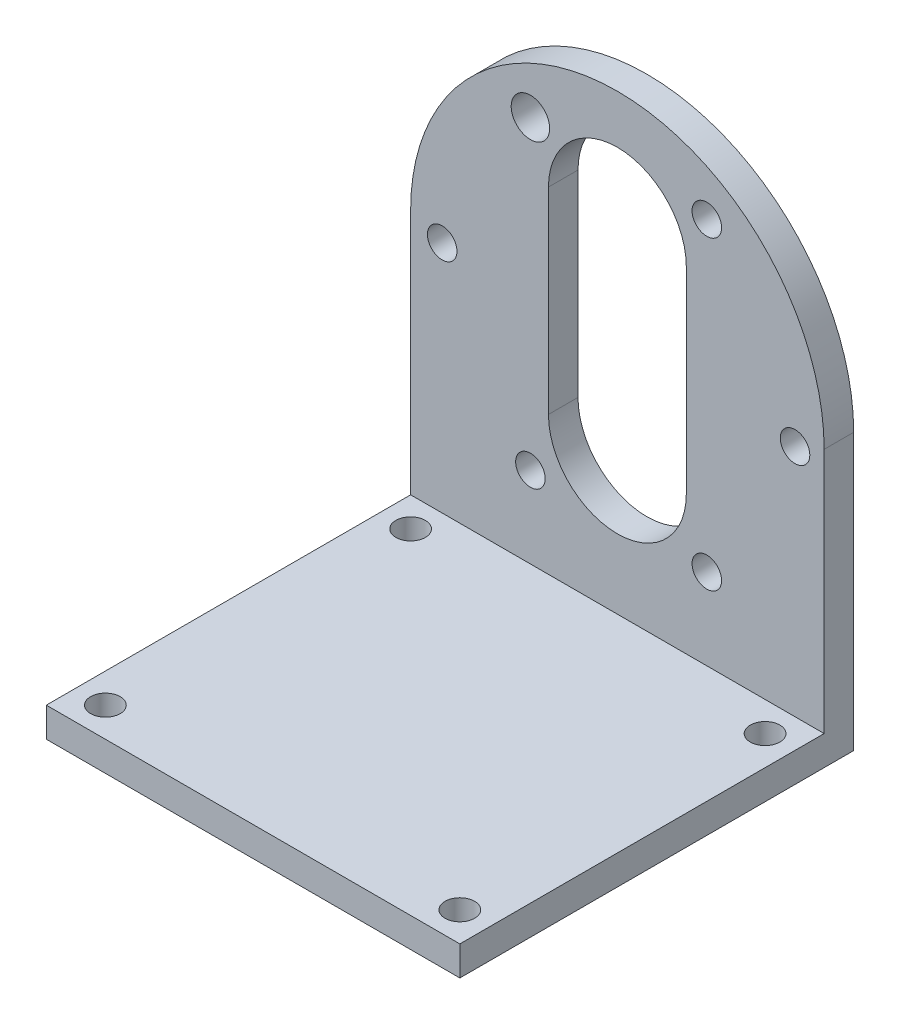
ISO-10303-21;
HEADER;
FILE_DESCRIPTION(('STEP AP214'),'2;1');
FILE_NAME('part.step','',(''),(''),'','','');
FILE_SCHEMA(('AUTOMOTIVE_DESIGN { 1 0 10303 214 1 1 1 1 }'));
ENDSEC;
DATA;
#1=APPLICATION_CONTEXT('core data for automotive mechanical design processes');
#2=APPLICATION_PROTOCOL_DEFINITION('international standard','automotive_design',2000,#1);
#3=PRODUCT_CONTEXT('',#1,'mechanical');
#4=PRODUCT('Part','Part','',(#3));
#5=PRODUCT_RELATED_PRODUCT_CATEGORY('part','',(#4));
#6=PRODUCT_DEFINITION_FORMATION('','',#4);
#7=PRODUCT_DEFINITION_CONTEXT('part definition',#1,'design');
#8=PRODUCT_DEFINITION('design','',#6,#7);
#9=PRODUCT_DEFINITION_SHAPE('','',#8);
#10=(LENGTH_UNIT() NAMED_UNIT(*) SI_UNIT(.MILLI.,.METRE.));
#11=(NAMED_UNIT(*) PLANE_ANGLE_UNIT() SI_UNIT($,.RADIAN.));
#12=(NAMED_UNIT(*) SI_UNIT($,.STERADIAN.) SOLID_ANGLE_UNIT());
#13=UNCERTAINTY_MEASURE_WITH_UNIT(LENGTH_MEASURE(1.E-05),#10,'distance_accuracy_value','');
#14=(GEOMETRIC_REPRESENTATION_CONTEXT(3) GLOBAL_UNCERTAINTY_ASSIGNED_CONTEXT((#13)) GLOBAL_UNIT_ASSIGNED_CONTEXT((#10,
#11,#12)) REPRESENTATION_CONTEXT('',''));
#15=CARTESIAN_POINT('',(0.,0.,0.));
#16=DIRECTION('',(0.,0.,1.));
#17=DIRECTION('',(1.,0.,0.));
#18=AXIS2_PLACEMENT_3D('',#15,#16,#17);
#19=CARTESIAN_POINT('',(-21.,3.,21.));
#20=DIRECTION('',(1.,0.,0.));
#21=DIRECTION('',(0.,0.,-1.));
#22=AXIS2_PLACEMENT_3D('',#19,#20,#21);
#23=PLANE('',#22);
#24=DIRECTION('',(0.,0.,1.));
#25=VECTOR('',#24,1.);
#26=CARTESIAN_POINT('',(-21.,0.,21.));
#27=LINE('',#26,#25);
#28=CARTESIAN_POINT('',(-21.,0.,-19.));
#29=VERTEX_POINT('',#28);
#30=CARTESIAN_POINT('',(-21.,0.,21.));
#31=VERTEX_POINT('',#30);
#32=EDGE_CURVE('E194',#29,#31,#27,.T.);
#33=ORIENTED_EDGE('',*,*,#32,.T.);
#34=DIRECTION('',(0.,-1.,0.));
#35=VECTOR('',#34,1.);
#36=CARTESIAN_POINT('',(-21.,3.,21.));
#37=LINE('',#36,#35);
#38=CARTESIAN_POINT('',(-21.,3.,21.));
#39=VERTEX_POINT('',#38);
#40=EDGE_CURVE('E11',#39,#31,#37,.T.);
#41=ORIENTED_EDGE('',*,*,#40,.F.);
#42=DIRECTION('',(0.,0.,1.));
#43=VECTOR('',#42,1.);
#44=CARTESIAN_POINT('',(-21.,3.,21.));
#45=LINE('',#44,#43);
#46=CARTESIAN_POINT('',(-21.,3.,-16.));
#47=VERTEX_POINT('',#46);
#48=EDGE_CURVE('E195',#47,#39,#45,.T.);
#49=ORIENTED_EDGE('',*,*,#48,.F.);
#50=DIRECTION('',(0.,1.,0.));
#51=VECTOR('',#50,1.);
#52=CARTESIAN_POINT('',(-21.,3.00000000000001,-16.));
#53=LINE('',#52,#51);
#54=CARTESIAN_POINT('',(-21.,28.,-16.0000000000001));
#55=VERTEX_POINT('',#54);
#56=EDGE_CURVE('E172',#47,#55,#53,.T.);
#57=ORIENTED_EDGE('',*,*,#56,.T.);
#58=DIRECTION('',(0.,0.,1.));
#59=VECTOR('',#58,1.);
#60=CARTESIAN_POINT('',(-21.,28.,-19.0000000000001));
#61=LINE('',#60,#59);
#62=CARTESIAN_POINT('',(-21.,28.,-19.));
#63=VERTEX_POINT('',#62);
#64=EDGE_CURVE('E180',#63,#55,#61,.T.);
#65=ORIENTED_EDGE('',*,*,#64,.F.);
#66=DIRECTION('',(0.,-1.,0.));
#67=VECTOR('',#66,1.);
#68=CARTESIAN_POINT('',(-21.,3.,-19.));
#69=LINE('',#68,#67);
#70=EDGE_CURVE('E206',#63,#29,#69,.T.);
#71=ORIENTED_EDGE('',*,*,#70,.T.);
#72=EDGE_LOOP('',(#33,#41,#49,#57,#65,#71));
#73=FACE_BOUND('',#72,.T.);
#74=ADVANCED_FACE('F39',(#73),#23,.F.);
#75=CARTESIAN_POINT('',(-21.,3.,21.));
#76=DIRECTION('',(0.,0.,-1.));
#77=DIRECTION('',(-1.,0.,0.));
#78=AXIS2_PLACEMENT_3D('',#75,#76,#77);
#79=PLANE('',#78);
#80=DIRECTION('',(1.,0.,0.));
#81=VECTOR('',#80,1.);
#82=CARTESIAN_POINT('',(-21.,0.,21.));
#83=LINE('',#82,#81);
#84=CARTESIAN_POINT('',(21.,0.,21.));
#85=VERTEX_POINT('',#84);
#86=EDGE_CURVE('E210',#31,#85,#83,.T.);
#87=ORIENTED_EDGE('',*,*,#86,.T.);
#88=DIRECTION('',(0.,-1.,0.));
#89=VECTOR('',#88,1.);
#90=CARTESIAN_POINT('',(21.,3.,21.));
#91=LINE('',#90,#89);
#92=CARTESIAN_POINT('',(21.,3.,21.));
#93=VERTEX_POINT('',#92);
#94=EDGE_CURVE('E47',#93,#85,#91,.T.);
#95=ORIENTED_EDGE('',*,*,#94,.F.);
#96=DIRECTION('',(1.,0.,0.));
#97=VECTOR('',#96,1.);
#98=CARTESIAN_POINT('',(-21.,3.,21.));
#99=LINE('',#98,#97);
#100=EDGE_CURVE('E198',#39,#93,#99,.T.);
#101=ORIENTED_EDGE('',*,*,#100,.F.);
#102=ORIENTED_EDGE('',*,*,#40,.T.);
#103=EDGE_LOOP('',(#87,#95,#101,#102));
#104=FACE_BOUND('',#103,.T.);
#105=ADVANCED_FACE('F251',(#104),#79,.F.);
#106=CARTESIAN_POINT('',(21.,3.,21.));
#107=DIRECTION('',(-1.,0.,0.));
#108=DIRECTION('',(0.,0.,1.));
#109=AXIS2_PLACEMENT_3D('',#106,#107,#108);
#110=PLANE('',#109);
#111=DIRECTION('',(0.,0.,-1.));
#112=VECTOR('',#111,1.);
#113=CARTESIAN_POINT('',(21.,0.,21.));
#114=LINE('',#113,#112);
#115=CARTESIAN_POINT('',(21.,0.,-19.));
#116=VERTEX_POINT('',#115);
#117=EDGE_CURVE('E213',#85,#116,#114,.T.);
#118=ORIENTED_EDGE('',*,*,#117,.T.);
#119=DIRECTION('',(0.,-1.,0.));
#120=VECTOR('',#119,1.);
#121=CARTESIAN_POINT('',(21.,3.,-19.));
#122=LINE('',#121,#120);
#123=CARTESIAN_POINT('',(21.,28.,-19.));
#124=VERTEX_POINT('',#123);
#125=EDGE_CURVE('E221',#124,#116,#122,.T.);
#126=ORIENTED_EDGE('',*,*,#125,.F.);
#127=DIRECTION('',(0.,0.,1.));
#128=VECTOR('',#127,1.);
#129=CARTESIAN_POINT('',(21.,28.,-19.0000000000001));
#130=LINE('',#129,#128);
#131=CARTESIAN_POINT('',(21.,28.,-16.));
#132=VERTEX_POINT('',#131);
#133=EDGE_CURVE('E179',#124,#132,#130,.T.);
#134=ORIENTED_EDGE('',*,*,#133,.T.);
#135=DIRECTION('',(0.,1.,0.));
#136=VECTOR('',#135,1.);
#137=CARTESIAN_POINT('',(21.,3.00000000000001,-16.));
#138=LINE('',#137,#136);
#139=CARTESIAN_POINT('',(21.,3.00000000000001,-16.));
#140=VERTEX_POINT('',#139);
#141=EDGE_CURVE('E175',#140,#132,#138,.T.);
#142=ORIENTED_EDGE('',*,*,#141,.F.);
#143=DIRECTION('',(0.,0.,-1.));
#144=VECTOR('',#143,1.);
#145=CARTESIAN_POINT('',(21.,3.,21.));
#146=LINE('',#145,#144);
#147=EDGE_CURVE('E202',#93,#140,#146,.T.);
#148=ORIENTED_EDGE('',*,*,#147,.F.);
#149=ORIENTED_EDGE('',*,*,#94,.T.);
#150=EDGE_LOOP('',(#118,#126,#134,#142,#148,#149));
#151=FACE_BOUND('',#150,.T.);
#152=ADVANCED_FACE('F230',(#151),#110,.F.);
#153=CARTESIAN_POINT('',(-21.,3.,-19.));
#154=DIRECTION('',(0.,0.,1.));
#155=DIRECTION('',(1.,0.,0.));
#156=AXIS2_PLACEMENT_3D('',#153,#154,#155);
#157=PLANE('',#156);
#158=CARTESIAN_POINT('',(-8.83266191937538,42.2794022057359,-19.));
#159=DIRECTION('',(0.,0.,1.));
#160=DIRECTION('',(1.,0.,0.));
#161=AXIS2_PLACEMENT_3D('',#158,#159,#160);
#162=CIRCLE('',#161,1.95230612866419);
#163=CARTESIAN_POINT('',(-6.88035579071119,42.2794022057359,-19.));
#164=VERTEX_POINT('',#163);
#165=EDGE_CURVE('E363',#164,#164,#162,.T.);
#166=ORIENTED_EDGE('',*,*,#165,.T.);
#167=EDGE_LOOP('',(#166));
#168=FACE_BOUND('',#167,.T.);
#169=CARTESIAN_POINT('',(9.08432994718287,42.2794022057359,-19.));
#170=DIRECTION('',(0.,0.,1.));
#171=DIRECTION('',(1.,0.,0.));
#172=AXIS2_PLACEMENT_3D('',#169,#170,#171);
#173=CIRCLE('',#172,1.5);
#174=CARTESIAN_POINT('',(10.5843299471829,42.2794022057359,-19.));
#175=VERTEX_POINT('',#174);
#176=EDGE_CURVE('E400',#175,#175,#173,.T.);
#177=ORIENTED_EDGE('',*,*,#176,.T.);
#178=EDGE_LOOP('',(#177));
#179=FACE_BOUND('',#178,.T.);
#180=CARTESIAN_POINT('',(18.042825880462,26.7628320898973,-19.));
#181=DIRECTION('',(0.,0.,1.));
#182=DIRECTION('',(1.,0.,0.));
#183=AXIS2_PLACEMENT_3D('',#180,#181,#182);
#184=CIRCLE('',#183,1.5);
#185=CARTESIAN_POINT('',(19.542825880462,26.7628320898973,-19.));
#186=VERTEX_POINT('',#185);
#187=EDGE_CURVE('E393',#186,#186,#184,.T.);
#188=ORIENTED_EDGE('',*,*,#187,.T.);
#189=EDGE_LOOP('',(#188));
#190=FACE_BOUND('',#189,.T.);
#191=CARTESIAN_POINT('',(9.08432994718288,11.2462619740587,-19.));
#192=DIRECTION('',(0.,0.,1.));
#193=DIRECTION('',(1.,0.,0.));
#194=AXIS2_PLACEMENT_3D('',#191,#192,#193);
#195=CIRCLE('',#194,1.5);
#196=CARTESIAN_POINT('',(10.5843299471829,11.2462619740587,-19.));
#197=VERTEX_POINT('',#196);
#198=EDGE_CURVE('E385',#197,#197,#195,.T.);
#199=ORIENTED_EDGE('',*,*,#198,.T.);
#200=EDGE_LOOP('',(#199));
#201=FACE_BOUND('',#200,.T.);
#202=CARTESIAN_POINT('',(-8.83266191937537,11.2462619740587,-19.));
#203=DIRECTION('',(0.,0.,1.));
#204=DIRECTION('',(1.,0.,0.));
#205=AXIS2_PLACEMENT_3D('',#202,#203,#204);
#206=CIRCLE('',#205,1.5);
#207=CARTESIAN_POINT('',(-7.33266191937537,11.2462619740587,-19.));
#208=VERTEX_POINT('',#207);
#209=EDGE_CURVE('E377',#208,#208,#206,.T.);
#210=ORIENTED_EDGE('',*,*,#209,.T.);
#211=EDGE_LOOP('',(#210));
#212=FACE_BOUND('',#211,.T.);
#213=CARTESIAN_POINT('',(-17.7911578526545,26.7628320898973,-19.));
#214=DIRECTION('',(0.,0.,1.));
#215=DIRECTION('',(1.,0.,0.));
#216=AXIS2_PLACEMENT_3D('',#213,#214,#215);
#217=CIRCLE('',#216,1.5);
#218=CARTESIAN_POINT('',(-16.2911578526545,26.7628320898973,-19.));
#219=VERTEX_POINT('',#218);
#220=EDGE_CURVE('E154',#219,#219,#217,.T.);
#221=ORIENTED_EDGE('',*,*,#220,.T.);
#222=EDGE_LOOP('',(#221));
#223=FACE_BOUND('',#222,.T.);
#224=DIRECTION('',(0.,1.,0.));
#225=VECTOR('',#224,1.);
#226=CARTESIAN_POINT('',(7.,37.0682739532329,-19.));
#227=LINE('',#226,#225);
#228=CARTESIAN_POINT('',(7.,17.0682739532329,-19.));
#229=VERTEX_POINT('',#228);
#230=CARTESIAN_POINT('',(7.,37.0682739532329,-19.));
#231=VERTEX_POINT('',#230);
#232=EDGE_CURVE('E125',#229,#231,#227,.T.);
#233=ORIENTED_EDGE('',*,*,#232,.T.);
#234=CARTESIAN_POINT('',(0.,37.0682739532329,-19.));
#235=DIRECTION('',(0.,0.,1.));
#236=DIRECTION('',(1.,0.,0.));
#237=AXIS2_PLACEMENT_3D('',#234,#235,#236);
#238=CIRCLE('',#237,7.);
#239=CARTESIAN_POINT('',(-7.,37.0682739532329,-19.));
#240=VERTEX_POINT('',#239);
#241=EDGE_CURVE('E118',#231,#240,#238,.T.);
#242=ORIENTED_EDGE('',*,*,#241,.T.);
#243=DIRECTION('',(0.,-1.,0.));
#244=VECTOR('',#243,1.);
#245=CARTESIAN_POINT('',(-7.,37.0682739532329,-19.));
#246=LINE('',#245,#244);
#247=CARTESIAN_POINT('',(-7.,17.0682739532329,-19.));
#248=VERTEX_POINT('',#247);
#249=EDGE_CURVE('E128',#240,#248,#246,.T.);
#250=ORIENTED_EDGE('',*,*,#249,.T.);
#251=CARTESIAN_POINT('',(0.,17.0682739532329,-19.));
#252=DIRECTION('',(0.,0.,1.));
#253=DIRECTION('',(1.,0.,0.));
#254=AXIS2_PLACEMENT_3D('',#251,#252,#253);
#255=CIRCLE('',#254,7.);
#256=EDGE_CURVE('E54',#248,#229,#255,.T.);
#257=ORIENTED_EDGE('',*,*,#256,.T.);
#258=EDGE_LOOP('',(#233,#242,#250,#257));
#259=FACE_BOUND('',#258,.T.);
#260=ORIENTED_EDGE('',*,*,#70,.F.);
#261=CARTESIAN_POINT('',(0.,28.,-19.));
#262=DIRECTION('',(0.,0.,1.));
#263=DIRECTION('',(1.,0.,0.));
#264=AXIS2_PLACEMENT_3D('',#261,#262,#263);
#265=CIRCLE('',#264,21.);
#266=EDGE_CURVE('E169',#124,#63,#265,.T.);
#267=ORIENTED_EDGE('',*,*,#266,.F.);
#268=ORIENTED_EDGE('',*,*,#125,.T.);
#269=DIRECTION('',(-1.,0.,0.));
#270=VECTOR('',#269,1.);
#271=CARTESIAN_POINT('',(-21.,0.,-19.));
#272=LINE('',#271,#270);
#273=EDGE_CURVE('E199',#116,#29,#272,.T.);
#274=ORIENTED_EDGE('',*,*,#273,.T.);
#275=EDGE_LOOP('',(#260,#267,#268,#274));
#276=FACE_BOUND('',#275,.T.);
#277=ADVANCED_FACE('F133',(#168,#179,#190,#201,#212,#223,#259,#276),#157,.F.);
#278=CARTESIAN_POINT('',(0.,3.,0.));
#279=DIRECTION('',(0.,-1.,0.));
#280=DIRECTION('',(0.,0.,-1.));
#281=AXIS2_PLACEMENT_3D('',#278,#279,#280);
#282=PLANE('',#281);
#283=CARTESIAN_POINT('',(18.,3.,-13.));
#284=DIRECTION('',(0.,1.,0.));
#285=DIRECTION('',(0.,0.,1.));
#286=AXIS2_PLACEMENT_3D('',#283,#284,#285);
#287=CIRCLE('',#286,1.5);
#288=CARTESIAN_POINT('',(18.,3.,-11.5));
#289=VERTEX_POINT('',#288);
#290=EDGE_CURVE('E344',#289,#289,#287,.T.);
#291=ORIENTED_EDGE('',*,*,#290,.F.);
#292=EDGE_LOOP('',(#291));
#293=FACE_BOUND('',#292,.T.);
#294=CARTESIAN_POINT('',(-18.,3.,18.));
#295=DIRECTION('',(0.,1.,0.));
#296=DIRECTION('',(0.,0.,1.));
#297=AXIS2_PLACEMENT_3D('',#294,#295,#296);
#298=CIRCLE('',#297,1.5);
#299=CARTESIAN_POINT('',(-18.,3.,19.5));
#300=VERTEX_POINT('',#299);
#301=EDGE_CURVE('E336',#300,#300,#298,.T.);
#302=ORIENTED_EDGE('',*,*,#301,.F.);
#303=EDGE_LOOP('',(#302));
#304=FACE_BOUND('',#303,.T.);
#305=CARTESIAN_POINT('',(18.,3.,18.));
#306=DIRECTION('',(0.,1.,0.));
#307=DIRECTION('',(0.,0.,1.));
#308=AXIS2_PLACEMENT_3D('',#305,#306,#307);
#309=CIRCLE('',#308,1.5);
#310=CARTESIAN_POINT('',(18.,3.,19.5));
#311=VERTEX_POINT('',#310);
#312=EDGE_CURVE('E331',#311,#311,#309,.T.);
#313=ORIENTED_EDGE('',*,*,#312,.F.);
#314=EDGE_LOOP('',(#313));
#315=FACE_BOUND('',#314,.T.);
#316=CARTESIAN_POINT('',(-18.,3.,-13.));
#317=DIRECTION('',(0.,1.,0.));
#318=DIRECTION('',(0.,0.,1.));
#319=AXIS2_PLACEMENT_3D('',#316,#317,#318);
#320=CIRCLE('',#319,1.5);
#321=CARTESIAN_POINT('',(-18.,3.,-11.5));
#322=VERTEX_POINT('',#321);
#323=EDGE_CURVE('E343',#322,#322,#320,.T.);
#324=ORIENTED_EDGE('',*,*,#323,.F.);
#325=EDGE_LOOP('',(#324));
#326=FACE_BOUND('',#325,.T.);
#327=ORIENTED_EDGE('',*,*,#147,.T.);
#328=DIRECTION('',(-1.,0.,0.));
#329=VECTOR('',#328,1.);
#330=CARTESIAN_POINT('',(21.,3.00000000000001,-16.));
#331=LINE('',#330,#329);
#332=EDGE_CURVE('E184',#140,#47,#331,.T.);
#333=ORIENTED_EDGE('',*,*,#332,.T.);
#334=ORIENTED_EDGE('',*,*,#48,.T.);
#335=ORIENTED_EDGE('',*,*,#100,.T.);
#336=EDGE_LOOP('',(#327,#333,#334,#335));
#337=FACE_BOUND('',#336,.T.);
#338=ADVANCED_FACE('F250',(#293,#304,#315,#326,#337),#282,.F.);
#339=CARTESIAN_POINT('',(0.,0.,0.));
#340=DIRECTION('',(0.,-1.,0.));
#341=DIRECTION('',(0.,0.,-1.));
#342=AXIS2_PLACEMENT_3D('',#339,#340,#341);
#343=PLANE('',#342);
#344=CARTESIAN_POINT('',(18.,0.,-13.));
#345=DIRECTION('',(0.,1.,0.));
#346=DIRECTION('',(0.,0.,1.));
#347=AXIS2_PLACEMENT_3D('',#344,#345,#346);
#348=CIRCLE('',#347,1.5);
#349=CARTESIAN_POINT('',(18.,0.,-11.5));
#350=VERTEX_POINT('',#349);
#351=EDGE_CURVE('E339',#350,#350,#348,.T.);
#352=ORIENTED_EDGE('',*,*,#351,.T.);
#353=EDGE_LOOP('',(#352));
#354=FACE_BOUND('',#353,.T.);
#355=CARTESIAN_POINT('',(-18.,0.,18.));
#356=DIRECTION('',(0.,1.,0.));
#357=DIRECTION('',(0.,0.,1.));
#358=AXIS2_PLACEMENT_3D('',#355,#356,#357);
#359=CIRCLE('',#358,1.5);
#360=CARTESIAN_POINT('',(-18.,0.,19.5));
#361=VERTEX_POINT('',#360);
#362=EDGE_CURVE('E348',#361,#361,#359,.T.);
#363=ORIENTED_EDGE('',*,*,#362,.T.);
#364=EDGE_LOOP('',(#363));
#365=FACE_BOUND('',#364,.T.);
#366=CARTESIAN_POINT('',(18.,0.,18.));
#367=DIRECTION('',(0.,1.,0.));
#368=DIRECTION('',(0.,0.,1.));
#369=AXIS2_PLACEMENT_3D('',#366,#367,#368);
#370=CIRCLE('',#369,1.5);
#371=CARTESIAN_POINT('',(18.,0.,19.5));
#372=VERTEX_POINT('',#371);
#373=EDGE_CURVE('E328',#372,#372,#370,.T.);
#374=ORIENTED_EDGE('',*,*,#373,.T.);
#375=EDGE_LOOP('',(#374));
#376=FACE_BOUND('',#375,.T.);
#377=CARTESIAN_POINT('',(-18.,0.,-13.));
#378=DIRECTION('',(0.,1.,0.));
#379=DIRECTION('',(0.,0.,1.));
#380=AXIS2_PLACEMENT_3D('',#377,#378,#379);
#381=CIRCLE('',#380,1.5);
#382=CARTESIAN_POINT('',(-18.,0.,-11.5));
#383=VERTEX_POINT('',#382);
#384=EDGE_CURVE('E355',#383,#383,#381,.T.);
#385=ORIENTED_EDGE('',*,*,#384,.T.);
#386=EDGE_LOOP('',(#385));
#387=FACE_BOUND('',#386,.T.);
#388=ORIENTED_EDGE('',*,*,#32,.F.);
#389=ORIENTED_EDGE('',*,*,#273,.F.);
#390=ORIENTED_EDGE('',*,*,#117,.F.);
#391=ORIENTED_EDGE('',*,*,#86,.F.);
#392=EDGE_LOOP('',(#388,#389,#390,#391));
#393=FACE_BOUND('',#392,.T.);
#394=ADVANCED_FACE('F238',(#354,#365,#376,#387,#393),#343,.T.);
#395=CARTESIAN_POINT('',(21.,3.00000000000001,-16.));
#396=DIRECTION('',(0.,0.,1.));
#397=DIRECTION('',(0.,-1.,0.));
#398=AXIS2_PLACEMENT_3D('',#395,#396,#397);
#399=PLANE('',#398);
#400=CARTESIAN_POINT('',(-8.83266191937538,42.2794022057359,-16.));
#401=DIRECTION('',(0.,0.,1.));
#402=DIRECTION('',(1.,0.,0.));
#403=AXIS2_PLACEMENT_3D('',#400,#401,#402);
#404=CIRCLE('',#403,1.95230612866419);
#405=CARTESIAN_POINT('',(-6.88035579071119,42.2794022057359,-16.));
#406=VERTEX_POINT('',#405);
#407=EDGE_CURVE('E359',#406,#406,#404,.T.);
#408=ORIENTED_EDGE('',*,*,#407,.F.);
#409=EDGE_LOOP('',(#408));
#410=FACE_BOUND('',#409,.T.);
#411=CARTESIAN_POINT('',(9.08432994718287,42.2794022057359,-16.));
#412=DIRECTION('',(0.,0.,1.));
#413=DIRECTION('',(1.,0.,0.));
#414=AXIS2_PLACEMENT_3D('',#411,#412,#413);
#415=CIRCLE('',#414,1.5);
#416=CARTESIAN_POINT('',(10.5843299471829,42.2794022057359,-16.));
#417=VERTEX_POINT('',#416);
#418=EDGE_CURVE('E144',#417,#417,#415,.T.);
#419=ORIENTED_EDGE('',*,*,#418,.F.);
#420=EDGE_LOOP('',(#419));
#421=FACE_BOUND('',#420,.T.);
#422=CARTESIAN_POINT('',(18.042825880462,26.7628320898973,-16.));
#423=DIRECTION('',(0.,0.,1.));
#424=DIRECTION('',(1.,0.,0.));
#425=AXIS2_PLACEMENT_3D('',#422,#423,#424);
#426=CIRCLE('',#425,1.5);
#427=CARTESIAN_POINT('',(19.542825880462,26.7628320898973,-16.));
#428=VERTEX_POINT('',#427);
#429=EDGE_CURVE('E397',#428,#428,#426,.T.);
#430=ORIENTED_EDGE('',*,*,#429,.F.);
#431=EDGE_LOOP('',(#430));
#432=FACE_BOUND('',#431,.T.);
#433=CARTESIAN_POINT('',(9.08432994718288,11.2462619740587,-16.));
#434=DIRECTION('',(0.,0.,1.));
#435=DIRECTION('',(1.,0.,0.));
#436=AXIS2_PLACEMENT_3D('',#433,#434,#435);
#437=CIRCLE('',#436,1.5);
#438=CARTESIAN_POINT('',(10.5843299471829,11.2462619740587,-16.));
#439=VERTEX_POINT('',#438);
#440=EDGE_CURVE('E389',#439,#439,#437,.T.);
#441=ORIENTED_EDGE('',*,*,#440,.F.);
#442=EDGE_LOOP('',(#441));
#443=FACE_BOUND('',#442,.T.);
#444=CARTESIAN_POINT('',(-8.83266191937537,11.2462619740587,-16.));
#445=DIRECTION('',(0.,0.,1.));
#446=DIRECTION('',(1.,0.,0.));
#447=AXIS2_PLACEMENT_3D('',#444,#445,#446);
#448=CIRCLE('',#447,1.5);
#449=CARTESIAN_POINT('',(-7.33266191937537,11.2462619740587,-16.));
#450=VERTEX_POINT('',#449);
#451=EDGE_CURVE('E381',#450,#450,#448,.T.);
#452=ORIENTED_EDGE('',*,*,#451,.F.);
#453=EDGE_LOOP('',(#452));
#454=FACE_BOUND('',#453,.T.);
#455=CARTESIAN_POINT('',(-17.7911578526545,26.7628320898973,-16.));
#456=DIRECTION('',(0.,0.,1.));
#457=DIRECTION('',(1.,0.,0.));
#458=AXIS2_PLACEMENT_3D('',#455,#456,#457);
#459=CIRCLE('',#458,1.5);
#460=CARTESIAN_POINT('',(-16.2911578526545,26.7628320898973,-16.));
#461=VERTEX_POINT('',#460);
#462=EDGE_CURVE('E373',#461,#461,#459,.T.);
#463=ORIENTED_EDGE('',*,*,#462,.F.);
#464=EDGE_LOOP('',(#463));
#465=FACE_BOUND('',#464,.T.);
#466=CARTESIAN_POINT('',(0.,37.0682739532329,-16.));
#467=DIRECTION('',(0.,0.,1.));
#468=DIRECTION('',(1.,0.,0.));
#469=AXIS2_PLACEMENT_3D('',#466,#467,#468);
#470=CIRCLE('',#469,7.);
#471=CARTESIAN_POINT('',(7.,37.0682739532329,-16.));
#472=VERTEX_POINT('',#471);
#473=CARTESIAN_POINT('',(-7.,37.0682739532329,-16.0000000000001));
#474=VERTEX_POINT('',#473);
#475=EDGE_CURVE('E62',#472,#474,#470,.T.);
#476=ORIENTED_EDGE('',*,*,#475,.F.);
#477=DIRECTION('',(0.,1.,0.));
#478=VECTOR('',#477,1.);
#479=CARTESIAN_POINT('',(7.,37.0682739532329,-16.));
#480=LINE('',#479,#478);
#481=CARTESIAN_POINT('',(7.,17.0682739532329,-16.));
#482=VERTEX_POINT('',#481);
#483=EDGE_CURVE('E137',#482,#472,#480,.T.);
#484=ORIENTED_EDGE('',*,*,#483,.F.);
#485=CARTESIAN_POINT('',(0.,17.0682739532329,-16.));
#486=DIRECTION('',(0.,0.,1.));
#487=DIRECTION('',(1.,0.,0.));
#488=AXIS2_PLACEMENT_3D('',#485,#486,#487);
#489=CIRCLE('',#488,7.);
#490=CARTESIAN_POINT('',(-7.,17.0682739532329,-16.));
#491=VERTEX_POINT('',#490);
#492=EDGE_CURVE('E141',#491,#482,#489,.T.);
#493=ORIENTED_EDGE('',*,*,#492,.F.);
#494=DIRECTION('',(0.,-1.,0.));
#495=VECTOR('',#494,1.);
#496=CARTESIAN_POINT('',(-7.,37.0682739532329,-16.));
#497=LINE('',#496,#495);
#498=EDGE_CURVE('E153',#474,#491,#497,.T.);
#499=ORIENTED_EDGE('',*,*,#498,.F.);
#500=EDGE_LOOP('',(#476,#484,#493,#499));
#501=FACE_BOUND('',#500,.T.);
#502=ORIENTED_EDGE('',*,*,#141,.T.);
#503=CARTESIAN_POINT('',(0.,28.,-16.));
#504=DIRECTION('',(0.,0.,1.));
#505=DIRECTION('',(1.,0.,0.));
#506=AXIS2_PLACEMENT_3D('',#503,#504,#505);
#507=CIRCLE('',#506,21.);
#508=EDGE_CURVE('E163',#132,#55,#507,.T.);
#509=ORIENTED_EDGE('',*,*,#508,.T.);
#510=ORIENTED_EDGE('',*,*,#56,.F.);
#511=ORIENTED_EDGE('',*,*,#332,.F.);
#512=EDGE_LOOP('',(#502,#509,#510,#511));
#513=FACE_BOUND('',#512,.T.);
#514=ADVANCED_FACE('F248',(#410,#421,#432,#443,#454,#465,#501,#513),#399,.T.);
#515=CARTESIAN_POINT('',(0.,28.,-19.));
#516=DIRECTION('',(0.,0.,1.));
#517=DIRECTION('',(1.,0.,0.));
#518=AXIS2_PLACEMENT_3D('',#515,#516,#517);
#519=CYLINDRICAL_SURFACE('',#518,21.);
#520=ORIENTED_EDGE('',*,*,#133,.F.);
#521=ORIENTED_EDGE('',*,*,#266,.T.);
#522=ORIENTED_EDGE('',*,*,#64,.T.);
#523=ORIENTED_EDGE('',*,*,#508,.F.);
#524=EDGE_LOOP('',(#520,#521,#522,#523));
#525=FACE_BOUND('',#524,.T.);
#526=ADVANCED_FACE('F246',(#525),#519,.T.);
#527=CARTESIAN_POINT('',(0.,37.0682739532329,-19.));
#528=DIRECTION('',(0.,0.,1.));
#529=DIRECTION('',(1.,0.,0.));
#530=AXIS2_PLACEMENT_3D('',#527,#528,#529);
#531=CYLINDRICAL_SURFACE('',#530,7.);
#532=ORIENTED_EDGE('',*,*,#475,.T.);
#533=DIRECTION('',(0.,0.,1.));
#534=VECTOR('',#533,1.);
#535=CARTESIAN_POINT('',(-7.,37.0682739532329,-19.));
#536=LINE('',#535,#534);
#537=EDGE_CURVE('E114',#240,#474,#536,.T.);
#538=ORIENTED_EDGE('',*,*,#537,.F.);
#539=ORIENTED_EDGE('',*,*,#241,.F.);
#540=DIRECTION('',(0.,0.,1.));
#541=VECTOR('',#540,1.);
#542=CARTESIAN_POINT('',(7.,37.0682739532329,-19.));
#543=LINE('',#542,#541);
#544=EDGE_CURVE('E160',#231,#472,#543,.T.);
#545=ORIENTED_EDGE('',*,*,#544,.T.);
#546=EDGE_LOOP('',(#532,#538,#539,#545));
#547=FACE_BOUND('',#546,.T.);
#548=ADVANCED_FACE('F116',(#547),#531,.F.);
#549=CARTESIAN_POINT('',(7.,37.0682739532329,-19.));
#550=DIRECTION('',(1.,0.,0.));
#551=DIRECTION('',(0.,1.,0.));
#552=AXIS2_PLACEMENT_3D('',#549,#550,#551);
#553=PLANE('',#552);
#554=ORIENTED_EDGE('',*,*,#483,.T.);
#555=ORIENTED_EDGE('',*,*,#544,.F.);
#556=ORIENTED_EDGE('',*,*,#232,.F.);
#557=DIRECTION('',(0.,0.,1.));
#558=VECTOR('',#557,1.);
#559=CARTESIAN_POINT('',(7.,17.0682739532329,-19.));
#560=LINE('',#559,#558);
#561=EDGE_CURVE('E164',#229,#482,#560,.T.);
#562=ORIENTED_EDGE('',*,*,#561,.T.);
#563=EDGE_LOOP('',(#554,#555,#556,#562));
#564=FACE_BOUND('',#563,.T.);
#565=ADVANCED_FACE('F275',(#564),#553,.F.);
#566=CARTESIAN_POINT('',(0.,17.0682739532329,-19.));
#567=DIRECTION('',(0.,0.,1.));
#568=DIRECTION('',(1.,0.,0.));
#569=AXIS2_PLACEMENT_3D('',#566,#567,#568);
#570=CYLINDRICAL_SURFACE('',#569,7.);
#571=ORIENTED_EDGE('',*,*,#492,.T.);
#572=ORIENTED_EDGE('',*,*,#561,.F.);
#573=ORIENTED_EDGE('',*,*,#256,.F.);
#574=DIRECTION('',(0.,0.,1.));
#575=VECTOR('',#574,1.);
#576=CARTESIAN_POINT('',(-7.,17.0682739532329,-19.));
#577=LINE('',#576,#575);
#578=EDGE_CURVE('E124',#248,#491,#577,.T.);
#579=ORIENTED_EDGE('',*,*,#578,.T.);
#580=EDGE_LOOP('',(#571,#572,#573,#579));
#581=FACE_BOUND('',#580,.T.);
#582=ADVANCED_FACE('F279',(#581),#570,.F.);
#583=CARTESIAN_POINT('',(-7.,37.0682739532329,-19.));
#584=DIRECTION('',(-1.,0.,0.));
#585=DIRECTION('',(0.,-1.,0.));
#586=AXIS2_PLACEMENT_3D('',#583,#584,#585);
#587=PLANE('',#586);
#588=ORIENTED_EDGE('',*,*,#498,.T.);
#589=ORIENTED_EDGE('',*,*,#578,.F.);
#590=ORIENTED_EDGE('',*,*,#249,.F.);
#591=ORIENTED_EDGE('',*,*,#537,.T.);
#592=EDGE_LOOP('',(#588,#589,#590,#591));
#593=FACE_BOUND('',#592,.T.);
#594=ADVANCED_FACE('F129',(#593),#587,.F.);
#595=CARTESIAN_POINT('',(-17.7911578526545,26.7628320898973,-19.));
#596=DIRECTION('',(0.,0.,1.));
#597=DIRECTION('',(1.,0.,0.));
#598=AXIS2_PLACEMENT_3D('',#595,#596,#597);
#599=CYLINDRICAL_SURFACE('',#598,1.5);
#600=ORIENTED_EDGE('',*,*,#220,.F.);
#601=EDGE_LOOP('',(#600));
#602=FACE_BOUND('',#601,.T.);
#603=ORIENTED_EDGE('',*,*,#462,.T.);
#604=EDGE_LOOP('',(#603));
#605=FACE_BOUND('',#604,.T.);
#606=ADVANCED_FACE('F278',(#602,#605),#599,.F.);
#607=CARTESIAN_POINT('',(-8.83266191937537,11.2462619740587,-19.));
#608=DIRECTION('',(0.,0.,1.));
#609=DIRECTION('',(1.,0.,0.));
#610=AXIS2_PLACEMENT_3D('',#607,#608,#609);
#611=CYLINDRICAL_SURFACE('',#610,1.5);
#612=ORIENTED_EDGE('',*,*,#209,.F.);
#613=EDGE_LOOP('',(#612));
#614=FACE_BOUND('',#613,.T.);
#615=ORIENTED_EDGE('',*,*,#451,.T.);
#616=EDGE_LOOP('',(#615));
#617=FACE_BOUND('',#616,.T.);
#618=ADVANCED_FACE('F297',(#614,#617),#611,.F.);
#619=CARTESIAN_POINT('',(9.08432994718288,11.2462619740587,-19.));
#620=DIRECTION('',(0.,0.,1.));
#621=DIRECTION('',(1.,0.,0.));
#622=AXIS2_PLACEMENT_3D('',#619,#620,#621);
#623=CYLINDRICAL_SURFACE('',#622,1.5);
#624=ORIENTED_EDGE('',*,*,#198,.F.);
#625=EDGE_LOOP('',(#624));
#626=FACE_BOUND('',#625,.T.);
#627=ORIENTED_EDGE('',*,*,#440,.T.);
#628=EDGE_LOOP('',(#627));
#629=FACE_BOUND('',#628,.T.);
#630=ADVANCED_FACE('F293',(#626,#629),#623,.F.);
#631=CARTESIAN_POINT('',(18.042825880462,26.7628320898973,-19.));
#632=DIRECTION('',(0.,0.,1.));
#633=DIRECTION('',(1.,0.,0.));
#634=AXIS2_PLACEMENT_3D('',#631,#632,#633);
#635=CYLINDRICAL_SURFACE('',#634,1.5);
#636=ORIENTED_EDGE('',*,*,#187,.F.);
#637=EDGE_LOOP('',(#636));
#638=FACE_BOUND('',#637,.T.);
#639=ORIENTED_EDGE('',*,*,#429,.T.);
#640=EDGE_LOOP('',(#639));
#641=FACE_BOUND('',#640,.T.);
#642=ADVANCED_FACE('F289',(#638,#641),#635,.F.);
#643=CARTESIAN_POINT('',(9.08432994718287,42.2794022057359,-19.));
#644=DIRECTION('',(0.,0.,1.));
#645=DIRECTION('',(1.,0.,0.));
#646=AXIS2_PLACEMENT_3D('',#643,#644,#645);
#647=CYLINDRICAL_SURFACE('',#646,1.5);
#648=ORIENTED_EDGE('',*,*,#176,.F.);
#649=EDGE_LOOP('',(#648));
#650=FACE_BOUND('',#649,.T.);
#651=ORIENTED_EDGE('',*,*,#418,.T.);
#652=EDGE_LOOP('',(#651));
#653=FACE_BOUND('',#652,.T.);
#654=ADVANCED_FACE('F285',(#650,#653),#647,.F.);
#655=CARTESIAN_POINT('',(-8.83266191937538,42.2794022057359,-19.));
#656=DIRECTION('',(0.,0.,1.));
#657=DIRECTION('',(1.,0.,0.));
#658=AXIS2_PLACEMENT_3D('',#655,#656,#657);
#659=CYLINDRICAL_SURFACE('',#658,1.95230612866419);
#660=ORIENTED_EDGE('',*,*,#165,.F.);
#661=EDGE_LOOP('',(#660));
#662=FACE_BOUND('',#661,.T.);
#663=ORIENTED_EDGE('',*,*,#407,.T.);
#664=EDGE_LOOP('',(#663));
#665=FACE_BOUND('',#664,.T.);
#666=ADVANCED_FACE('F288',(#662,#665),#659,.F.);
#667=CARTESIAN_POINT('',(-18.,0.,-13.));
#668=DIRECTION('',(0.,1.,0.));
#669=DIRECTION('',(0.,0.,1.));
#670=AXIS2_PLACEMENT_3D('',#667,#668,#669);
#671=CYLINDRICAL_SURFACE('',#670,1.5);
#672=ORIENTED_EDGE('',*,*,#384,.F.);
#673=EDGE_LOOP('',(#672));
#674=FACE_BOUND('',#673,.T.);
#675=ORIENTED_EDGE('',*,*,#323,.T.);
#676=EDGE_LOOP('',(#675));
#677=FACE_BOUND('',#676,.T.);
#678=ADVANCED_FACE('F307',(#674,#677),#671,.F.);
#679=CARTESIAN_POINT('',(18.,0.,18.));
#680=DIRECTION('',(0.,1.,0.));
#681=DIRECTION('',(0.,0.,1.));
#682=AXIS2_PLACEMENT_3D('',#679,#680,#681);
#683=CYLINDRICAL_SURFACE('',#682,1.5);
#684=ORIENTED_EDGE('',*,*,#373,.F.);
#685=EDGE_LOOP('',(#684));
#686=FACE_BOUND('',#685,.T.);
#687=ORIENTED_EDGE('',*,*,#312,.T.);
#688=EDGE_LOOP('',(#687));
#689=FACE_BOUND('',#688,.T.);
#690=ADVANCED_FACE('F311',(#686,#689),#683,.F.);
#691=CARTESIAN_POINT('',(-18.,0.,18.));
#692=DIRECTION('',(0.,1.,0.));
#693=DIRECTION('',(0.,0.,1.));
#694=AXIS2_PLACEMENT_3D('',#691,#692,#693);
#695=CYLINDRICAL_SURFACE('',#694,1.5);
#696=ORIENTED_EDGE('',*,*,#362,.F.);
#697=EDGE_LOOP('',(#696));
#698=FACE_BOUND('',#697,.T.);
#699=ORIENTED_EDGE('',*,*,#301,.T.);
#700=EDGE_LOOP('',(#699));
#701=FACE_BOUND('',#700,.T.);
#702=ADVANCED_FACE('F313',(#698,#701),#695,.F.);
#703=CARTESIAN_POINT('',(18.,0.,-13.));
#704=DIRECTION('',(0.,1.,0.));
#705=DIRECTION('',(0.,0.,1.));
#706=AXIS2_PLACEMENT_3D('',#703,#704,#705);
#707=CYLINDRICAL_SURFACE('',#706,1.5);
#708=ORIENTED_EDGE('',*,*,#351,.F.);
#709=EDGE_LOOP('',(#708));
#710=FACE_BOUND('',#709,.T.);
#711=ORIENTED_EDGE('',*,*,#290,.T.);
#712=EDGE_LOOP('',(#711));
#713=FACE_BOUND('',#712,.T.);
#714=ADVANCED_FACE('F316',(#710,#713),#707,.F.);
#715=CLOSED_SHELL('',(#74,#105,#152,#277,#338,#394,#514,#526,#548,#565,#582,#594,#606,#618,#630,
#642,#654,#666,#678,#690,#702,#714));
#716=MANIFOLD_SOLID_BREP('B2',#715);
#717=ADVANCED_BREP_SHAPE_REPRESENTATION('',(#18,#716),#14);
#718=SHAPE_DEFINITION_REPRESENTATION(#9,#717);
ENDSEC;
END-ISO-10303-21;
